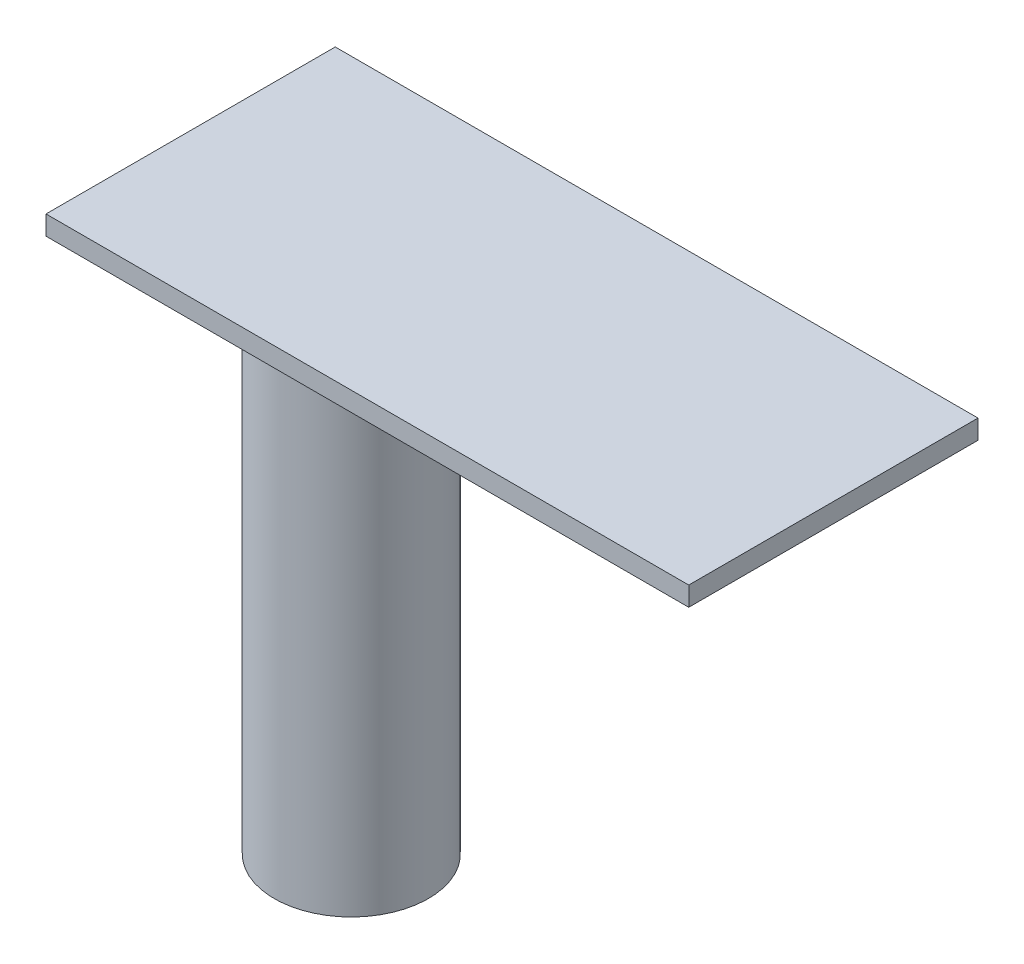
ISO-10303-21;
HEADER;
FILE_DESCRIPTION(('STEP AP214'),'2;1');
FILE_NAME('part.step','',(''),(''),'','','');
FILE_SCHEMA(('AUTOMOTIVE_DESIGN { 1 0 10303 214 1 1 1 1 }'));
ENDSEC;
DATA;
#1=APPLICATION_CONTEXT('core data for automotive mechanical design processes');
#2=APPLICATION_PROTOCOL_DEFINITION('international standard','automotive_design',2000,#1);
#3=PRODUCT_CONTEXT('',#1,'mechanical');
#4=PRODUCT('Part','Part','',(#3));
#5=PRODUCT_RELATED_PRODUCT_CATEGORY('part','',(#4));
#6=PRODUCT_DEFINITION_FORMATION('','',#4);
#7=PRODUCT_DEFINITION_CONTEXT('part definition',#1,'design');
#8=PRODUCT_DEFINITION('design','',#6,#7);
#9=PRODUCT_DEFINITION_SHAPE('','',#8);
#10=(LENGTH_UNIT() NAMED_UNIT(*) SI_UNIT(.MILLI.,.METRE.));
#11=(NAMED_UNIT(*) PLANE_ANGLE_UNIT() SI_UNIT($,.RADIAN.));
#12=(NAMED_UNIT(*) SI_UNIT($,.STERADIAN.) SOLID_ANGLE_UNIT());
#13=UNCERTAINTY_MEASURE_WITH_UNIT(LENGTH_MEASURE(1.E-05),#10,'distance_accuracy_value','');
#14=(GEOMETRIC_REPRESENTATION_CONTEXT(3) GLOBAL_UNCERTAINTY_ASSIGNED_CONTEXT((#13)) GLOBAL_UNIT_ASSIGNED_CONTEXT((#10,
#11,#12)) REPRESENTATION_CONTEXT('',''));
#15=CARTESIAN_POINT('',(0.,0.,0.));
#16=DIRECTION('',(0.,0.,1.));
#17=DIRECTION('',(1.,0.,0.));
#18=AXIS2_PLACEMENT_3D('',#15,#16,#17);
#19=CARTESIAN_POINT('',(0.,3.,0.));
#20=DIRECTION('',(1.,0.,0.));
#21=DIRECTION('',(0.,0.,-1.));
#22=AXIS2_PLACEMENT_3D('',#19,#20,#21);
#23=PLANE('',#22);
#24=DIRECTION('',(0.,0.,1.));
#25=VECTOR('',#24,1.);
#26=CARTESIAN_POINT('',(0.,0.,0.));
#27=LINE('',#26,#25);
#28=CARTESIAN_POINT('',(0.,0.,-45.));
#29=VERTEX_POINT('',#28);
#30=CARTESIAN_POINT('',(0.,0.,0.));
#31=VERTEX_POINT('',#30);
#32=EDGE_CURVE('E99',#29,#31,#27,.T.);
#33=ORIENTED_EDGE('',*,*,#32,.T.);
#34=DIRECTION('',(0.,-1.,0.));
#35=VECTOR('',#34,1.);
#36=CARTESIAN_POINT('',(0.,3.,0.));
#37=LINE('',#36,#35);
#38=CARTESIAN_POINT('',(0.,3.,0.));
#39=VERTEX_POINT('',#38);
#40=EDGE_CURVE('E11',#39,#31,#37,.T.);
#41=ORIENTED_EDGE('',*,*,#40,.F.);
#42=DIRECTION('',(0.,0.,1.));
#43=VECTOR('',#42,1.);
#44=CARTESIAN_POINT('',(0.,3.,0.));
#45=LINE('',#44,#43);
#46=CARTESIAN_POINT('',(0.,3.,-45.));
#47=VERTEX_POINT('',#46);
#48=EDGE_CURVE('E87',#47,#39,#45,.T.);
#49=ORIENTED_EDGE('',*,*,#48,.F.);
#50=DIRECTION('',(0.,-1.,0.));
#51=VECTOR('',#50,1.);
#52=CARTESIAN_POINT('',(0.,3.,-45.));
#53=LINE('',#52,#51);
#54=EDGE_CURVE('E95',#47,#29,#53,.T.);
#55=ORIENTED_EDGE('',*,*,#54,.T.);
#56=EDGE_LOOP('',(#33,#41,#49,#55));
#57=FACE_BOUND('',#56,.T.);
#58=ADVANCED_FACE('F36',(#57),#23,.F.);
#59=CARTESIAN_POINT('',(0.,3.,0.));
#60=DIRECTION('',(0.,0.,-1.));
#61=DIRECTION('',(-1.,0.,0.));
#62=AXIS2_PLACEMENT_3D('',#59,#60,#61);
#63=PLANE('',#62);
#64=DIRECTION('',(1.,0.,0.));
#65=VECTOR('',#64,1.);
#66=CARTESIAN_POINT('',(0.,0.,0.));
#67=LINE('',#66,#65);
#68=CARTESIAN_POINT('',(100.,0.,0.));
#69=VERTEX_POINT('',#68);
#70=EDGE_CURVE('E91',#31,#69,#67,.T.);
#71=ORIENTED_EDGE('',*,*,#70,.T.);
#72=DIRECTION('',(0.,-1.,0.));
#73=VECTOR('',#72,1.);
#74=CARTESIAN_POINT('',(100.,3.,0.));
#75=LINE('',#74,#73);
#76=CARTESIAN_POINT('',(100.,3.,0.));
#77=VERTEX_POINT('',#76);
#78=EDGE_CURVE('E44',#77,#69,#75,.T.);
#79=ORIENTED_EDGE('',*,*,#78,.F.);
#80=DIRECTION('',(1.,0.,0.));
#81=VECTOR('',#80,1.);
#82=CARTESIAN_POINT('',(0.,3.,0.));
#83=LINE('',#82,#81);
#84=EDGE_CURVE('E82',#39,#77,#83,.T.);
#85=ORIENTED_EDGE('',*,*,#84,.F.);
#86=ORIENTED_EDGE('',*,*,#40,.T.);
#87=EDGE_LOOP('',(#71,#79,#85,#86));
#88=FACE_BOUND('',#87,.T.);
#89=ADVANCED_FACE('F90',(#88),#63,.F.);
#90=CARTESIAN_POINT('',(100.,3.,0.));
#91=DIRECTION('',(-1.,0.,0.));
#92=DIRECTION('',(0.,0.,1.));
#93=AXIS2_PLACEMENT_3D('',#90,#91,#92);
#94=PLANE('',#93);
#95=DIRECTION('',(0.,0.,-1.));
#96=VECTOR('',#95,1.);
#97=CARTESIAN_POINT('',(100.,0.,0.));
#98=LINE('',#97,#96);
#99=CARTESIAN_POINT('',(100.,0.,-45.));
#100=VERTEX_POINT('',#99);
#101=EDGE_CURVE('E69',#69,#100,#98,.T.);
#102=ORIENTED_EDGE('',*,*,#101,.T.);
#103=DIRECTION('',(0.,-1.,0.));
#104=VECTOR('',#103,1.);
#105=CARTESIAN_POINT('',(100.,3.,-45.));
#106=LINE('',#105,#104);
#107=CARTESIAN_POINT('',(100.,3.,-45.));
#108=VERTEX_POINT('',#107);
#109=EDGE_CURVE('E92',#108,#100,#106,.T.);
#110=ORIENTED_EDGE('',*,*,#109,.F.);
#111=DIRECTION('',(0.,0.,-1.));
#112=VECTOR('',#111,1.);
#113=CARTESIAN_POINT('',(100.,3.,0.));
#114=LINE('',#113,#112);
#115=EDGE_CURVE('E85',#77,#108,#114,.T.);
#116=ORIENTED_EDGE('',*,*,#115,.F.);
#117=ORIENTED_EDGE('',*,*,#78,.T.);
#118=EDGE_LOOP('',(#102,#110,#116,#117));
#119=FACE_BOUND('',#118,.T.);
#120=ADVANCED_FACE('F93',(#119),#94,.F.);
#121=CARTESIAN_POINT('',(0.,3.,-45.));
#122=DIRECTION('',(0.,0.,1.));
#123=DIRECTION('',(1.,0.,0.));
#124=AXIS2_PLACEMENT_3D('',#121,#122,#123);
#125=PLANE('',#124);
#126=DIRECTION('',(-1.,0.,0.));
#127=VECTOR('',#126,1.);
#128=CARTESIAN_POINT('',(0.,0.,-45.));
#129=LINE('',#128,#127);
#130=EDGE_CURVE('E75',#100,#29,#129,.T.);
#131=ORIENTED_EDGE('',*,*,#130,.T.);
#132=ORIENTED_EDGE('',*,*,#54,.F.);
#133=DIRECTION('',(-1.,0.,0.));
#134=VECTOR('',#133,1.);
#135=CARTESIAN_POINT('',(0.,3.,-45.));
#136=LINE('',#135,#134);
#137=EDGE_CURVE('E52',#108,#47,#136,.T.);
#138=ORIENTED_EDGE('',*,*,#137,.F.);
#139=ORIENTED_EDGE('',*,*,#109,.T.);
#140=EDGE_LOOP('',(#131,#132,#138,#139));
#141=FACE_BOUND('',#140,.T.);
#142=ADVANCED_FACE('F107',(#141),#125,.F.);
#143=CARTESIAN_POINT('',(0.,3.,0.));
#144=DIRECTION('',(0.,-1.,0.));
#145=DIRECTION('',(0.,0.,-1.));
#146=AXIS2_PLACEMENT_3D('',#143,#144,#145);
#147=PLANE('',#146);
#148=ORIENTED_EDGE('',*,*,#48,.T.);
#149=ORIENTED_EDGE('',*,*,#84,.T.);
#150=ORIENTED_EDGE('',*,*,#115,.T.);
#151=ORIENTED_EDGE('',*,*,#137,.T.);
#152=EDGE_LOOP('',(#148,#149,#150,#151));
#153=FACE_BOUND('',#152,.T.);
#154=ADVANCED_FACE('F83',(#153),#147,.F.);
#155=CARTESIAN_POINT('',(0.,0.,0.));
#156=DIRECTION('',(0.,-1.,0.));
#157=DIRECTION('',(0.,0.,-1.));
#158=AXIS2_PLACEMENT_3D('',#155,#156,#157);
#159=PLANE('',#158);
#160=CARTESIAN_POINT('',(25.,0.,-22.5));
#161=DIRECTION('',(0.,-1.,0.));
#162=DIRECTION('',(0.,0.,-1.));
#163=AXIS2_PLACEMENT_3D('',#160,#161,#162);
#164=CIRCLE('',#163,12.);
#165=CARTESIAN_POINT('',(25.,0.,-34.5));
#166=VERTEX_POINT('',#165);
#167=EDGE_CURVE('E113',#166,#166,#164,.T.);
#168=ORIENTED_EDGE('',*,*,#167,.F.);
#169=EDGE_LOOP('',(#168));
#170=FACE_BOUND('',#169,.T.);
#171=ORIENTED_EDGE('',*,*,#32,.F.);
#172=ORIENTED_EDGE('',*,*,#130,.F.);
#173=ORIENTED_EDGE('',*,*,#101,.F.);
#174=ORIENTED_EDGE('',*,*,#70,.F.);
#175=EDGE_LOOP('',(#171,#172,#173,#174));
#176=FACE_BOUND('',#175,.T.);
#177=ADVANCED_FACE('F110',(#170,#176),#159,.T.);
#178=CARTESIAN_POINT('',(25.,-82.,-22.5));
#179=DIRECTION('',(0.,1.,0.));
#180=DIRECTION('',(0.,0.,1.));
#181=AXIS2_PLACEMENT_3D('',#178,#179,#180);
#182=CYLINDRICAL_SURFACE('',#181,12.);
#183=CARTESIAN_POINT('',(25.,-82.,-22.5));
#184=DIRECTION('',(0.,-1.,0.));
#185=DIRECTION('',(0.,0.,-1.));
#186=AXIS2_PLACEMENT_3D('',#183,#184,#185);
#187=CIRCLE('',#186,12.);
#188=CARTESIAN_POINT('',(25.,-82.,-34.5));
#189=VERTEX_POINT('',#188);
#190=EDGE_CURVE('E102',#189,#189,#187,.T.);
#191=ORIENTED_EDGE('',*,*,#190,.F.);
#192=EDGE_LOOP('',(#191));
#193=FACE_BOUND('',#192,.T.);
#194=ORIENTED_EDGE('',*,*,#167,.T.);
#195=EDGE_LOOP('',(#194));
#196=FACE_BOUND('',#195,.T.);
#197=ADVANCED_FACE('F121',(#193,#196),#182,.T.);
#198=CARTESIAN_POINT('',(25.,-82.,-22.5));
#199=DIRECTION('',(0.,-1.,0.));
#200=DIRECTION('',(0.,0.,-1.));
#201=AXIS2_PLACEMENT_3D('',#198,#199,#200);
#202=PLANE('',#201);
#203=ORIENTED_EDGE('',*,*,#190,.T.);
#204=EDGE_LOOP('',(#203));
#205=FACE_BOUND('',#204,.T.);
#206=ADVANCED_FACE('F119',(#205),#202,.T.);
#207=CLOSED_SHELL('',(#58,#89,#120,#142,#154,#177,#197,#206));
#208=MANIFOLD_SOLID_BREP('B2',#207);
#209=ADVANCED_BREP_SHAPE_REPRESENTATION('',(#18,#208),#14);
#210=SHAPE_DEFINITION_REPRESENTATION(#9,#209);
ENDSEC;
END-ISO-10303-21;
